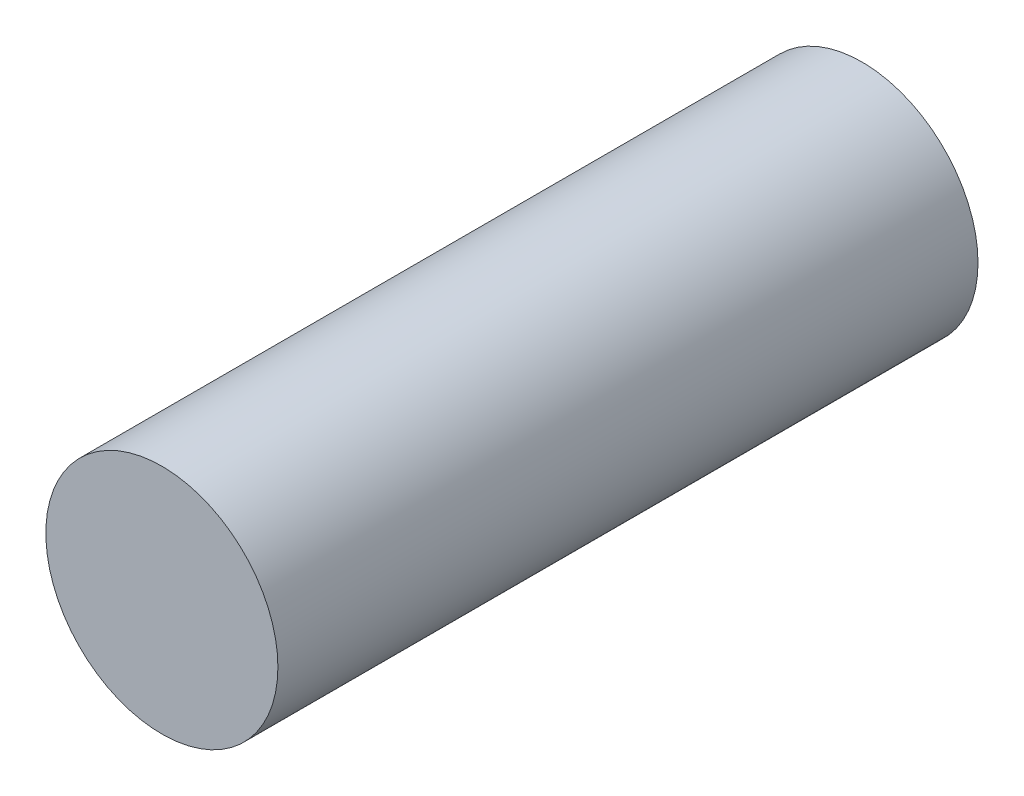
ISO-10303-21;
HEADER;
FILE_DESCRIPTION(('STEP AP214'),'2;1');
FILE_NAME('part.step','',(''),(''),'','','');
FILE_SCHEMA(('AUTOMOTIVE_DESIGN { 1 0 10303 214 1 1 1 1 }'));
ENDSEC;
DATA;
#1=APPLICATION_CONTEXT('core data for automotive mechanical design processes');
#2=APPLICATION_PROTOCOL_DEFINITION('international standard','automotive_design',2000,#1);
#3=PRODUCT_CONTEXT('',#1,'mechanical');
#4=PRODUCT('Part','Part','',(#3));
#5=PRODUCT_RELATED_PRODUCT_CATEGORY('part','',(#4));
#6=PRODUCT_DEFINITION_FORMATION('','',#4);
#7=PRODUCT_DEFINITION_CONTEXT('part definition',#1,'design');
#8=PRODUCT_DEFINITION('design','',#6,#7);
#9=PRODUCT_DEFINITION_SHAPE('','',#8);
#10=(LENGTH_UNIT() NAMED_UNIT(*) SI_UNIT(.MILLI.,.METRE.));
#11=(NAMED_UNIT(*) PLANE_ANGLE_UNIT() SI_UNIT($,.RADIAN.));
#12=(NAMED_UNIT(*) SI_UNIT($,.STERADIAN.) SOLID_ANGLE_UNIT());
#13=UNCERTAINTY_MEASURE_WITH_UNIT(LENGTH_MEASURE(1.E-05),#10,'distance_accuracy_value','');
#14=(GEOMETRIC_REPRESENTATION_CONTEXT(3) GLOBAL_UNCERTAINTY_ASSIGNED_CONTEXT((#13)) GLOBAL_UNIT_ASSIGNED_CONTEXT((#10,
#11,#12)) REPRESENTATION_CONTEXT('',''));
#15=CARTESIAN_POINT('',(0.,0.,0.));
#16=DIRECTION('',(0.,0.,1.));
#17=DIRECTION('',(1.,0.,0.));
#18=AXIS2_PLACEMENT_3D('',#15,#16,#17);
#19=CARTESIAN_POINT('',(0.,0.,-9.779));
#20=DIRECTION('',(0.,0.,1.));
#21=DIRECTION('',(1.,0.,0.));
#22=AXIS2_PLACEMENT_3D('',#19,#20,#21);
#23=PLANE('',#22);
#24=CARTESIAN_POINT('',(0.,0.,-9.779));
#25=DIRECTION('',(0.,0.,1.));
#26=DIRECTION('',(1.,0.,0.));
#27=AXIS2_PLACEMENT_3D('',#24,#25,#26);
#28=CIRCLE('',#27,3.175);
#29=CARTESIAN_POINT('',(3.175,0.,-9.779));
#30=VERTEX_POINT('',#29);
#31=EDGE_CURVE('E18',#30,#30,#28,.T.);
#32=ORIENTED_EDGE('',*,*,#31,.F.);
#33=EDGE_LOOP('',(#32));
#34=FACE_BOUND('',#33,.T.);
#35=ADVANCED_FACE('F14',(#34),#23,.F.);
#36=CARTESIAN_POINT('',(0.,0.,9.379));
#37=DIRECTION('',(0.,0.,1.));
#38=DIRECTION('',(1.,0.,0.));
#39=AXIS2_PLACEMENT_3D('',#36,#37,#38);
#40=PLANE('',#39);
#41=CARTESIAN_POINT('',(0.,0.,9.379));
#42=DIRECTION('',(0.,0.,1.));
#43=DIRECTION('',(1.,0.,0.));
#44=AXIS2_PLACEMENT_3D('',#41,#42,#43);
#45=CIRCLE('',#44,3.175);
#46=CARTESIAN_POINT('',(3.175,0.,9.379));
#47=VERTEX_POINT('',#46);
#48=EDGE_CURVE('E10',#47,#47,#45,.T.);
#49=ORIENTED_EDGE('',*,*,#48,.T.);
#50=EDGE_LOOP('',(#49));
#51=FACE_BOUND('',#50,.T.);
#52=ADVANCED_FACE('F16',(#51),#40,.T.);
#53=CARTESIAN_POINT('',(0.,0.,-12.465));
#54=DIRECTION('',(0.,0.,1.));
#55=DIRECTION('',(1.,0.,0.));
#56=AXIS2_PLACEMENT_3D('',#53,#54,#55);
#57=CYLINDRICAL_SURFACE('',#56,3.175);
#58=ORIENTED_EDGE('',*,*,#48,.F.);
#59=EDGE_LOOP('',(#58));
#60=FACE_BOUND('',#59,.T.);
#61=ORIENTED_EDGE('',*,*,#31,.T.);
#62=EDGE_LOOP('',(#61));
#63=FACE_BOUND('',#62,.T.);
#64=ADVANCED_FACE('F27',(#60,#63),#57,.T.);
#65=CLOSED_SHELL('',(#35,#52,#64));
#66=MANIFOLD_SOLID_BREP('B1',#65);
#67=ADVANCED_BREP_SHAPE_REPRESENTATION('',(#18,#66),#14);
#68=SHAPE_DEFINITION_REPRESENTATION(#9,#67);
ENDSEC;
END-ISO-10303-21;
